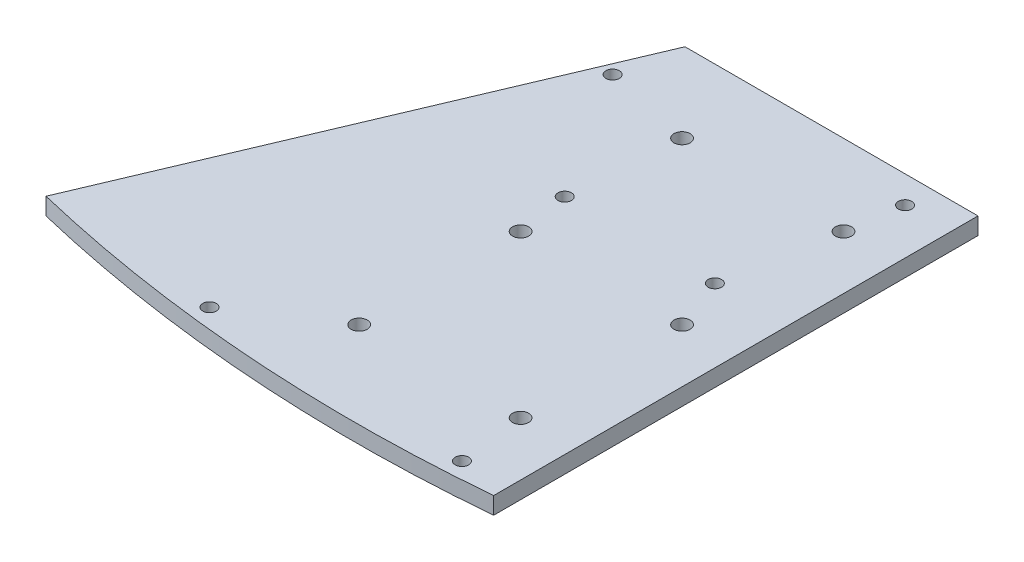
ISO-10303-21;
HEADER;
FILE_DESCRIPTION(('STEP AP214'),'2;1');
FILE_NAME('part.step','',(''),(''),'','','');
FILE_SCHEMA(('AUTOMOTIVE_DESIGN { 1 0 10303 214 1 1 1 1 }'));
ENDSEC;
DATA;
#1=APPLICATION_CONTEXT('core data for automotive mechanical design processes');
#2=APPLICATION_PROTOCOL_DEFINITION('international standard','automotive_design',2000,#1);
#3=PRODUCT_CONTEXT('',#1,'mechanical');
#4=PRODUCT('Part','Part','',(#3));
#5=PRODUCT_RELATED_PRODUCT_CATEGORY('part','',(#4));
#6=PRODUCT_DEFINITION_FORMATION('','',#4);
#7=PRODUCT_DEFINITION_CONTEXT('part definition',#1,'design');
#8=PRODUCT_DEFINITION('design','',#6,#7);
#9=PRODUCT_DEFINITION_SHAPE('','',#8);
#10=(LENGTH_UNIT() NAMED_UNIT(*) SI_UNIT(.MILLI.,.METRE.));
#11=(NAMED_UNIT(*) PLANE_ANGLE_UNIT() SI_UNIT($,.RADIAN.));
#12=(NAMED_UNIT(*) SI_UNIT($,.STERADIAN.) SOLID_ANGLE_UNIT());
#13=UNCERTAINTY_MEASURE_WITH_UNIT(LENGTH_MEASURE(1.E-05),#10,'distance_accuracy_value','');
#14=(GEOMETRIC_REPRESENTATION_CONTEXT(3) GLOBAL_UNCERTAINTY_ASSIGNED_CONTEXT((#13)) GLOBAL_UNIT_ASSIGNED_CONTEXT((#10,
#11,#12)) REPRESENTATION_CONTEXT('',''));
#15=CARTESIAN_POINT('',(0.,0.,0.));
#16=DIRECTION('',(0.,0.,1.));
#17=DIRECTION('',(1.,0.,0.));
#18=AXIS2_PLACEMENT_3D('',#15,#16,#17);
#19=CARTESIAN_POINT('',(-15.,3.175,-260.));
#20=DIRECTION('',(0.,1.,0.));
#21=DIRECTION('',(0.,0.,1.));
#22=AXIS2_PLACEMENT_3D('',#19,#20,#21);
#23=PLANE('',#22);
#24=CARTESIAN_POINT('',(-46.7,3.175,11.1));
#25=DIRECTION('',(0.,1.,0.));
#26=DIRECTION('',(0.,0.,1.));
#27=AXIS2_PLACEMENT_3D('',#24,#25,#26);
#28=CIRCLE('',#27,1.25);
#29=CARTESIAN_POINT('',(-46.7,3.175,12.35));
#30=VERTEX_POINT('',#29);
#31=EDGE_CURVE('E168',#30,#30,#28,.T.);
#32=ORIENTED_EDGE('',*,*,#31,.F.);
#33=EDGE_LOOP('',(#32));
#34=FACE_BOUND('',#33,.T.);
#35=CARTESIAN_POINT('',(-31.5,3.175,-39.7));
#36=DIRECTION('',(0.,1.,0.));
#37=DIRECTION('',(0.,0.,1.));
#38=AXIS2_PLACEMENT_3D('',#35,#36,#37);
#39=CIRCLE('',#38,1.25);
#40=CARTESIAN_POINT('',(-31.5,3.175,-38.45));
#41=VERTEX_POINT('',#40);
#42=EDGE_CURVE('E156',#41,#41,#39,.T.);
#43=ORIENTED_EDGE('',*,*,#42,.F.);
#44=EDGE_LOOP('',(#43));
#45=FACE_BOUND('',#44,.T.);
#46=CARTESIAN_POINT('',(-46.7,3.175,-63.8));
#47=DIRECTION('',(0.,1.,0.));
#48=DIRECTION('',(0.,0.,1.));
#49=AXIS2_PLACEMENT_3D('',#46,#47,#48);
#50=CIRCLE('',#49,1.25);
#51=CARTESIAN_POINT('',(-46.7,3.175,-62.55));
#52=VERTEX_POINT('',#51);
#53=EDGE_CURVE('E144',#52,#52,#50,.T.);
#54=ORIENTED_EDGE('',*,*,#53,.F.);
#55=EDGE_LOOP('',(#54));
#56=FACE_BOUND('',#55,.T.);
#57=CARTESIAN_POINT('',(0.,3.175,-60.));
#58=DIRECTION('',(0.,1.,0.));
#59=DIRECTION('',(0.,0.,1.));
#60=AXIS2_PLACEMENT_3D('',#57,#58,#59);
#61=CIRCLE('',#60,1.5);
#62=CARTESIAN_POINT('',(0.,3.175,-58.5));
#63=VERTEX_POINT('',#62);
#64=EDGE_CURVE('E132',#63,#63,#61,.T.);
#65=ORIENTED_EDGE('',*,*,#64,.F.);
#66=EDGE_LOOP('',(#65));
#67=FACE_BOUND('',#66,.T.);
#68=CARTESIAN_POINT('',(-30.,3.175,-30.));
#69=DIRECTION('',(0.,1.,0.));
#70=DIRECTION('',(0.,0.,1.));
#71=AXIS2_PLACEMENT_3D('',#68,#69,#70);
#72=CIRCLE('',#71,1.5);
#73=CARTESIAN_POINT('',(-30.,3.175,-28.5));
#74=VERTEX_POINT('',#73);
#75=EDGE_CURVE('E120',#74,#74,#72,.T.);
#76=ORIENTED_EDGE('',*,*,#75,.F.);
#77=EDGE_LOOP('',(#76));
#78=FACE_BOUND('',#77,.T.);
#79=CARTESIAN_POINT('',(0.,3.175,0.));
#80=DIRECTION('',(0.,1.,0.));
#81=DIRECTION('',(0.,0.,1.));
#82=AXIS2_PLACEMENT_3D('',#79,#80,#81);
#83=CIRCLE('',#82,1.5);
#84=CARTESIAN_POINT('',(0.,3.175,1.5));
#85=VERTEX_POINT('',#84);
#86=EDGE_CURVE('E99',#85,#85,#83,.T.);
#87=ORIENTED_EDGE('',*,*,#86,.F.);
#88=EDGE_LOOP('',(#87));
#89=FACE_BOUND('',#88,.T.);
#90=CARTESIAN_POINT('',(-15.,3.175,-260.));
#91=DIRECTION('',(0.,1.,0.));
#92=DIRECTION('',(0.,0.,1.));
#93=AXIS2_PLACEMENT_3D('',#90,#91,#92);
#94=CIRCLE('',#93,276.134025429682);
#95=CARTESIAN_POINT('',(-79.768950838685,3.175,8.4305925323267));
#96=VERTEX_POINT('',#95);
#97=CARTESIAN_POINT('',(10.,3.175,15.));
#98=VERTEX_POINT('',#97);
#99=EDGE_CURVE('E84',#96,#98,#94,.T.);
#100=ORIENTED_EDGE('',*,*,#99,.T.);
#101=DIRECTION('',(0.,0.,-1.));
#102=VECTOR('',#101,1.);
#103=CARTESIAN_POINT('',(9.99999999999999,3.175,-75.));
#104=LINE('',#103,#102);
#105=CARTESIAN_POINT('',(9.99999999999999,3.175,-75.));
#106=VERTEX_POINT('',#105);
#107=EDGE_CURVE('E79',#98,#106,#104,.T.);
#108=ORIENTED_EDGE('',*,*,#107,.T.);
#109=DIRECTION('',(-1.,0.,0.));
#110=VECTOR('',#109,1.);
#111=CARTESIAN_POINT('',(-44.45,3.175,-75.));
#112=LINE('',#111,#110);
#113=CARTESIAN_POINT('',(-44.45,3.175,-75.));
#114=VERTEX_POINT('',#113);
#115=EDGE_CURVE('E82',#106,#114,#112,.T.);
#116=ORIENTED_EDGE('',*,*,#115,.T.);
#117=DIRECTION('',(-0.389840257198187,0.,0.920882497318551));
#118=VECTOR('',#117,1.);
#119=CARTESIAN_POINT('',(-44.45,3.175,-75.));
#120=LINE('',#119,#118);
#121=EDGE_CURVE('E49',#114,#96,#120,.T.);
#122=ORIENTED_EDGE('',*,*,#121,.T.);
#123=EDGE_LOOP('',(#100,#108,#116,#122));
#124=FACE_BOUND('',#123,.T.);
#125=CARTESIAN_POINT('',(-30.,3.175,0.));
#126=DIRECTION('',(0.,1.,0.));
#127=DIRECTION('',(0.,0.,1.));
#128=AXIS2_PLACEMENT_3D('',#125,#126,#127);
#129=CIRCLE('',#128,1.50000000000001);
#130=CARTESIAN_POINT('',(-30.,3.175,1.50000000000001));
#131=VERTEX_POINT('',#130);
#132=EDGE_CURVE('E114',#131,#131,#129,.T.);
#133=ORIENTED_EDGE('',*,*,#132,.F.);
#134=EDGE_LOOP('',(#133));
#135=FACE_BOUND('',#134,.T.);
#136=CARTESIAN_POINT('',(-30.,3.175,-60.));
#137=DIRECTION('',(0.,1.,0.));
#138=DIRECTION('',(0.,0.,1.));
#139=AXIS2_PLACEMENT_3D('',#136,#137,#138);
#140=CIRCLE('',#139,1.5);
#141=CARTESIAN_POINT('',(-30.,3.175,-58.5));
#142=VERTEX_POINT('',#141);
#143=EDGE_CURVE('E126',#142,#142,#140,.T.);
#144=ORIENTED_EDGE('',*,*,#143,.F.);
#145=EDGE_LOOP('',(#144));
#146=FACE_BOUND('',#145,.T.);
#147=CARTESIAN_POINT('',(0.,3.175,-30.));
#148=DIRECTION('',(0.,1.,0.));
#149=DIRECTION('',(0.,0.,1.));
#150=AXIS2_PLACEMENT_3D('',#147,#148,#149);
#151=CIRCLE('',#150,1.5);
#152=CARTESIAN_POINT('',(0.,3.175,-28.5));
#153=VERTEX_POINT('',#152);
#154=EDGE_CURVE('E138',#153,#153,#151,.T.);
#155=ORIENTED_EDGE('',*,*,#154,.F.);
#156=EDGE_LOOP('',(#155));
#157=FACE_BOUND('',#156,.T.);
#158=CARTESIAN_POINT('',(1.49999999999999,3.175,-69.95));
#159=DIRECTION('',(0.,1.,0.));
#160=DIRECTION('',(0.,0.,1.));
#161=AXIS2_PLACEMENT_3D('',#158,#159,#160);
#162=CIRCLE('',#161,1.25);
#163=CARTESIAN_POINT('',(1.49999999999999,3.175,-68.7));
#164=VERTEX_POINT('',#163);
#165=EDGE_CURVE('E150',#164,#164,#162,.T.);
#166=ORIENTED_EDGE('',*,*,#165,.F.);
#167=EDGE_LOOP('',(#166));
#168=FACE_BOUND('',#167,.T.);
#169=CARTESIAN_POINT('',(-3.60000000000002,3.175,-39.7));
#170=DIRECTION('',(0.,1.,0.));
#171=DIRECTION('',(0.,0.,1.));
#172=AXIS2_PLACEMENT_3D('',#169,#170,#171);
#173=CIRCLE('',#172,1.25);
#174=CARTESIAN_POINT('',(-3.60000000000002,3.175,-38.45));
#175=VERTEX_POINT('',#174);
#176=EDGE_CURVE('E162',#175,#175,#173,.T.);
#177=ORIENTED_EDGE('',*,*,#176,.F.);
#178=EDGE_LOOP('',(#177));
#179=FACE_BOUND('',#178,.T.);
#180=CARTESIAN_POINT('',(1.5,3.175,12.4));
#181=DIRECTION('',(0.,1.,0.));
#182=DIRECTION('',(0.,0.,1.));
#183=AXIS2_PLACEMENT_3D('',#180,#181,#182);
#184=CIRCLE('',#183,1.25);
#185=CARTESIAN_POINT('',(1.5,3.175,13.65));
#186=VERTEX_POINT('',#185);
#187=EDGE_CURVE('E174',#186,#186,#184,.T.);
#188=ORIENTED_EDGE('',*,*,#187,.F.);
#189=EDGE_LOOP('',(#188));
#190=FACE_BOUND('',#189,.T.);
#191=ADVANCED_FACE('F32',(#34,#45,#56,#67,#78,#89,#124,#135,#146,#157,#168,#179,#190),#23,.T.);
#192=CARTESIAN_POINT('',(-15.,0.,-260.));
#193=DIRECTION('',(0.,1.,0.));
#194=DIRECTION('',(0.,0.,1.));
#195=AXIS2_PLACEMENT_3D('',#192,#193,#194);
#196=PLANE('',#195);
#197=CARTESIAN_POINT('',(-46.7,0.,11.1));
#198=DIRECTION('',(0.,1.,0.));
#199=DIRECTION('',(0.,0.,1.));
#200=AXIS2_PLACEMENT_3D('',#197,#198,#199);
#201=CIRCLE('',#200,1.25);
#202=CARTESIAN_POINT('',(-46.7,0.,12.35));
#203=VERTEX_POINT('',#202);
#204=EDGE_CURVE('E171',#203,#203,#201,.T.);
#205=ORIENTED_EDGE('',*,*,#204,.T.);
#206=EDGE_LOOP('',(#205));
#207=FACE_BOUND('',#206,.T.);
#208=CARTESIAN_POINT('',(-31.5,0.,-39.7));
#209=DIRECTION('',(0.,1.,0.));
#210=DIRECTION('',(0.,0.,1.));
#211=AXIS2_PLACEMENT_3D('',#208,#209,#210);
#212=CIRCLE('',#211,1.25);
#213=CARTESIAN_POINT('',(-31.5,0.,-38.45));
#214=VERTEX_POINT('',#213);
#215=EDGE_CURVE('E159',#214,#214,#212,.T.);
#216=ORIENTED_EDGE('',*,*,#215,.T.);
#217=EDGE_LOOP('',(#216));
#218=FACE_BOUND('',#217,.T.);
#219=CARTESIAN_POINT('',(-46.7,0.,-63.8));
#220=DIRECTION('',(0.,1.,0.));
#221=DIRECTION('',(0.,0.,1.));
#222=AXIS2_PLACEMENT_3D('',#219,#220,#221);
#223=CIRCLE('',#222,1.25);
#224=CARTESIAN_POINT('',(-46.7,0.,-62.55));
#225=VERTEX_POINT('',#224);
#226=EDGE_CURVE('E147',#225,#225,#223,.T.);
#227=ORIENTED_EDGE('',*,*,#226,.T.);
#228=EDGE_LOOP('',(#227));
#229=FACE_BOUND('',#228,.T.);
#230=CARTESIAN_POINT('',(0.,0.,-60.));
#231=DIRECTION('',(0.,1.,0.));
#232=DIRECTION('',(0.,0.,1.));
#233=AXIS2_PLACEMENT_3D('',#230,#231,#232);
#234=CIRCLE('',#233,1.5);
#235=CARTESIAN_POINT('',(0.,0.,-58.5));
#236=VERTEX_POINT('',#235);
#237=EDGE_CURVE('E135',#236,#236,#234,.T.);
#238=ORIENTED_EDGE('',*,*,#237,.T.);
#239=EDGE_LOOP('',(#238));
#240=FACE_BOUND('',#239,.T.);
#241=CARTESIAN_POINT('',(-30.,0.,-30.));
#242=DIRECTION('',(0.,1.,0.));
#243=DIRECTION('',(0.,0.,1.));
#244=AXIS2_PLACEMENT_3D('',#241,#242,#243);
#245=CIRCLE('',#244,1.5);
#246=CARTESIAN_POINT('',(-30.,0.,-28.5));
#247=VERTEX_POINT('',#246);
#248=EDGE_CURVE('E123',#247,#247,#245,.T.);
#249=ORIENTED_EDGE('',*,*,#248,.T.);
#250=EDGE_LOOP('',(#249));
#251=FACE_BOUND('',#250,.T.);
#252=CARTESIAN_POINT('',(0.,0.,0.));
#253=DIRECTION('',(0.,1.,0.));
#254=DIRECTION('',(0.,0.,1.));
#255=AXIS2_PLACEMENT_3D('',#252,#253,#254);
#256=CIRCLE('',#255,1.5);
#257=CARTESIAN_POINT('',(0.,0.,1.5));
#258=VERTEX_POINT('',#257);
#259=EDGE_CURVE('E111',#258,#258,#256,.T.);
#260=ORIENTED_EDGE('',*,*,#259,.T.);
#261=EDGE_LOOP('',(#260));
#262=FACE_BOUND('',#261,.T.);
#263=CARTESIAN_POINT('',(-15.,0.,-260.));
#264=DIRECTION('',(0.,1.,0.));
#265=DIRECTION('',(0.,0.,1.));
#266=AXIS2_PLACEMENT_3D('',#263,#264,#265);
#267=CIRCLE('',#266,276.134025429682);
#268=CARTESIAN_POINT('',(-79.768950838685,0.,8.4305925323267));
#269=VERTEX_POINT('',#268);
#270=CARTESIAN_POINT('',(10.,0.,15.));
#271=VERTEX_POINT('',#270);
#272=EDGE_CURVE('E96',#269,#271,#267,.T.);
#273=ORIENTED_EDGE('',*,*,#272,.F.);
#274=DIRECTION('',(-0.389840257198187,0.,0.920882497318551));
#275=VECTOR('',#274,1.);
#276=CARTESIAN_POINT('',(-44.45,0.,-75.));
#277=LINE('',#276,#275);
#278=CARTESIAN_POINT('',(-44.45,0.,-75.));
#279=VERTEX_POINT('',#278);
#280=EDGE_CURVE('E72',#279,#269,#277,.T.);
#281=ORIENTED_EDGE('',*,*,#280,.F.);
#282=DIRECTION('',(-1.,0.,0.));
#283=VECTOR('',#282,1.);
#284=CARTESIAN_POINT('',(-44.45,0.,-75.));
#285=LINE('',#284,#283);
#286=CARTESIAN_POINT('',(9.99999999999999,0.,-75.));
#287=VERTEX_POINT('',#286);
#288=EDGE_CURVE('E66',#287,#279,#285,.T.);
#289=ORIENTED_EDGE('',*,*,#288,.F.);
#290=DIRECTION('',(0.,0.,-1.));
#291=VECTOR('',#290,1.);
#292=CARTESIAN_POINT('',(9.99999999999999,0.,-75.));
#293=LINE('',#292,#291);
#294=EDGE_CURVE('E88',#271,#287,#293,.T.);
#295=ORIENTED_EDGE('',*,*,#294,.F.);
#296=EDGE_LOOP('',(#273,#281,#289,#295));
#297=FACE_BOUND('',#296,.T.);
#298=CARTESIAN_POINT('',(-30.,0.,0.));
#299=DIRECTION('',(0.,1.,0.));
#300=DIRECTION('',(0.,0.,1.));
#301=AXIS2_PLACEMENT_3D('',#298,#299,#300);
#302=CIRCLE('',#301,1.50000000000001);
#303=CARTESIAN_POINT('',(-30.,0.,1.50000000000001));
#304=VERTEX_POINT('',#303);
#305=EDGE_CURVE('E117',#304,#304,#302,.T.);
#306=ORIENTED_EDGE('',*,*,#305,.T.);
#307=EDGE_LOOP('',(#306));
#308=FACE_BOUND('',#307,.T.);
#309=CARTESIAN_POINT('',(-30.,0.,-60.));
#310=DIRECTION('',(0.,1.,0.));
#311=DIRECTION('',(0.,0.,1.));
#312=AXIS2_PLACEMENT_3D('',#309,#310,#311);
#313=CIRCLE('',#312,1.5);
#314=CARTESIAN_POINT('',(-30.,0.,-58.5));
#315=VERTEX_POINT('',#314);
#316=EDGE_CURVE('E129',#315,#315,#313,.T.);
#317=ORIENTED_EDGE('',*,*,#316,.T.);
#318=EDGE_LOOP('',(#317));
#319=FACE_BOUND('',#318,.T.);
#320=CARTESIAN_POINT('',(0.,0.,-30.));
#321=DIRECTION('',(0.,1.,0.));
#322=DIRECTION('',(0.,0.,1.));
#323=AXIS2_PLACEMENT_3D('',#320,#321,#322);
#324=CIRCLE('',#323,1.5);
#325=CARTESIAN_POINT('',(0.,0.,-28.5));
#326=VERTEX_POINT('',#325);
#327=EDGE_CURVE('E141',#326,#326,#324,.T.);
#328=ORIENTED_EDGE('',*,*,#327,.T.);
#329=EDGE_LOOP('',(#328));
#330=FACE_BOUND('',#329,.T.);
#331=CARTESIAN_POINT('',(1.49999999999999,0.,-69.95));
#332=DIRECTION('',(0.,1.,0.));
#333=DIRECTION('',(0.,0.,1.));
#334=AXIS2_PLACEMENT_3D('',#331,#332,#333);
#335=CIRCLE('',#334,1.25);
#336=CARTESIAN_POINT('',(1.49999999999999,0.,-68.7));
#337=VERTEX_POINT('',#336);
#338=EDGE_CURVE('E153',#337,#337,#335,.T.);
#339=ORIENTED_EDGE('',*,*,#338,.T.);
#340=EDGE_LOOP('',(#339));
#341=FACE_BOUND('',#340,.T.);
#342=CARTESIAN_POINT('',(-3.60000000000002,0.,-39.7));
#343=DIRECTION('',(0.,1.,0.));
#344=DIRECTION('',(0.,0.,1.));
#345=AXIS2_PLACEMENT_3D('',#342,#343,#344);
#346=CIRCLE('',#345,1.25);
#347=CARTESIAN_POINT('',(-3.60000000000002,0.,-38.45));
#348=VERTEX_POINT('',#347);
#349=EDGE_CURVE('E165',#348,#348,#346,.T.);
#350=ORIENTED_EDGE('',*,*,#349,.T.);
#351=EDGE_LOOP('',(#350));
#352=FACE_BOUND('',#351,.T.);
#353=CARTESIAN_POINT('',(1.5,0.,12.4));
#354=DIRECTION('',(0.,1.,0.));
#355=DIRECTION('',(0.,0.,1.));
#356=AXIS2_PLACEMENT_3D('',#353,#354,#355);
#357=CIRCLE('',#356,1.25);
#358=CARTESIAN_POINT('',(1.5,0.,13.65));
#359=VERTEX_POINT('',#358);
#360=EDGE_CURVE('E177',#359,#359,#357,.T.);
#361=ORIENTED_EDGE('',*,*,#360,.T.);
#362=EDGE_LOOP('',(#361));
#363=FACE_BOUND('',#362,.T.);
#364=ADVANCED_FACE('F107',(#207,#218,#229,#240,#251,#262,#297,#308,#319,#330,#341,#352,#363),
#196,.F.);
#365=CARTESIAN_POINT('',(-15.,3.175,-260.));
#366=DIRECTION('',(0.,-1.,0.));
#367=DIRECTION('',(0.,0.,-1.));
#368=AXIS2_PLACEMENT_3D('',#365,#366,#367);
#369=CYLINDRICAL_SURFACE('',#368,276.134025429682);
#370=ORIENTED_EDGE('',*,*,#272,.T.);
#371=DIRECTION('',(0.,-1.,0.));
#372=VECTOR('',#371,1.);
#373=CARTESIAN_POINT('',(10.,3.175,15.));
#374=LINE('',#373,#372);
#375=EDGE_CURVE('E11',#98,#271,#374,.T.);
#376=ORIENTED_EDGE('',*,*,#375,.F.);
#377=ORIENTED_EDGE('',*,*,#99,.F.);
#378=DIRECTION('',(0.,-1.,0.));
#379=VECTOR('',#378,1.);
#380=CARTESIAN_POINT('',(-79.768950838685,3.175,8.4305925323267));
#381=LINE('',#380,#379);
#382=EDGE_CURVE('E92',#96,#269,#381,.T.);
#383=ORIENTED_EDGE('',*,*,#382,.T.);
#384=EDGE_LOOP('',(#370,#376,#377,#383));
#385=FACE_BOUND('',#384,.T.);
#386=ADVANCED_FACE('F34',(#385),#369,.T.);
#387=CARTESIAN_POINT('',(9.99999999999999,3.175,-75.));
#388=DIRECTION('',(-1.,0.,0.));
#389=DIRECTION('',(0.,0.,1.));
#390=AXIS2_PLACEMENT_3D('',#387,#388,#389);
#391=PLANE('',#390);
#392=ORIENTED_EDGE('',*,*,#294,.T.);
#393=DIRECTION('',(0.,-1.,0.));
#394=VECTOR('',#393,1.);
#395=CARTESIAN_POINT('',(9.99999999999999,3.175,-75.));
#396=LINE('',#395,#394);
#397=EDGE_CURVE('E41',#106,#287,#396,.T.);
#398=ORIENTED_EDGE('',*,*,#397,.F.);
#399=ORIENTED_EDGE('',*,*,#107,.F.);
#400=ORIENTED_EDGE('',*,*,#375,.T.);
#401=EDGE_LOOP('',(#392,#398,#399,#400));
#402=FACE_BOUND('',#401,.T.);
#403=ADVANCED_FACE('F87',(#402),#391,.F.);
#404=CARTESIAN_POINT('',(-44.45,3.175,-75.));
#405=DIRECTION('',(0.,0.,1.));
#406=DIRECTION('',(1.,0.,0.));
#407=AXIS2_PLACEMENT_3D('',#404,#405,#406);
#408=PLANE('',#407);
#409=ORIENTED_EDGE('',*,*,#288,.T.);
#410=DIRECTION('',(0.,-1.,0.));
#411=VECTOR('',#410,1.);
#412=CARTESIAN_POINT('',(-44.45,3.175,-75.));
#413=LINE('',#412,#411);
#414=EDGE_CURVE('E89',#114,#279,#413,.T.);
#415=ORIENTED_EDGE('',*,*,#414,.F.);
#416=ORIENTED_EDGE('',*,*,#115,.F.);
#417=ORIENTED_EDGE('',*,*,#397,.T.);
#418=EDGE_LOOP('',(#409,#415,#416,#417));
#419=FACE_BOUND('',#418,.T.);
#420=ADVANCED_FACE('F90',(#419),#408,.F.);
#421=CARTESIAN_POINT('',(-44.45,3.175,-75.));
#422=DIRECTION('',(0.920882497318551,0.,0.389840257198187));
#423=DIRECTION('',(0.389840257198187,0.,-0.920882497318551));
#424=AXIS2_PLACEMENT_3D('',#421,#422,#423);
#425=PLANE('',#424);
#426=ORIENTED_EDGE('',*,*,#280,.T.);
#427=ORIENTED_EDGE('',*,*,#382,.F.);
#428=ORIENTED_EDGE('',*,*,#121,.F.);
#429=ORIENTED_EDGE('',*,*,#414,.T.);
#430=EDGE_LOOP('',(#426,#427,#428,#429));
#431=FACE_BOUND('',#430,.T.);
#432=ADVANCED_FACE('F104',(#431),#425,.F.);
#433=CARTESIAN_POINT('',(0.,3.175,0.));
#434=DIRECTION('',(0.,-1.,0.));
#435=DIRECTION('',(0.,0.,-1.));
#436=AXIS2_PLACEMENT_3D('',#433,#434,#435);
#437=CYLINDRICAL_SURFACE('',#436,1.5);
#438=ORIENTED_EDGE('',*,*,#86,.T.);
#439=EDGE_LOOP('',(#438));
#440=FACE_BOUND('',#439,.T.);
#441=ORIENTED_EDGE('',*,*,#259,.F.);
#442=EDGE_LOOP('',(#441));
#443=FACE_BOUND('',#442,.T.);
#444=ADVANCED_FACE('F197',(#440,#443),#437,.F.);
#445=CARTESIAN_POINT('',(-30.,3.175,0.));
#446=DIRECTION('',(0.,-1.,0.));
#447=DIRECTION('',(0.,0.,-1.));
#448=AXIS2_PLACEMENT_3D('',#445,#446,#447);
#449=CYLINDRICAL_SURFACE('',#448,1.50000000000001);
#450=ORIENTED_EDGE('',*,*,#132,.T.);
#451=EDGE_LOOP('',(#450));
#452=FACE_BOUND('',#451,.T.);
#453=ORIENTED_EDGE('',*,*,#305,.F.);
#454=EDGE_LOOP('',(#453));
#455=FACE_BOUND('',#454,.T.);
#456=ADVANCED_FACE('F243',(#452,#455),#449,.F.);
#457=CARTESIAN_POINT('',(-30.,3.175,-30.));
#458=DIRECTION('',(0.,-1.,0.));
#459=DIRECTION('',(0.,0.,-1.));
#460=AXIS2_PLACEMENT_3D('',#457,#458,#459);
#461=CYLINDRICAL_SURFACE('',#460,1.5);
#462=ORIENTED_EDGE('',*,*,#75,.T.);
#463=EDGE_LOOP('',(#462));
#464=FACE_BOUND('',#463,.T.);
#465=ORIENTED_EDGE('',*,*,#248,.F.);
#466=EDGE_LOOP('',(#465));
#467=FACE_BOUND('',#466,.T.);
#468=ADVANCED_FACE('F251',(#464,#467),#461,.F.);
#469=CARTESIAN_POINT('',(-30.,3.175,-60.));
#470=DIRECTION('',(0.,-1.,0.));
#471=DIRECTION('',(0.,0.,-1.));
#472=AXIS2_PLACEMENT_3D('',#469,#470,#471);
#473=CYLINDRICAL_SURFACE('',#472,1.5);
#474=ORIENTED_EDGE('',*,*,#143,.T.);
#475=EDGE_LOOP('',(#474));
#476=FACE_BOUND('',#475,.T.);
#477=ORIENTED_EDGE('',*,*,#316,.F.);
#478=EDGE_LOOP('',(#477));
#479=FACE_BOUND('',#478,.T.);
#480=ADVANCED_FACE('F259',(#476,#479),#473,.F.);
#481=CARTESIAN_POINT('',(0.,3.175,-60.));
#482=DIRECTION('',(0.,-1.,0.));
#483=DIRECTION('',(0.,0.,-1.));
#484=AXIS2_PLACEMENT_3D('',#481,#482,#483);
#485=CYLINDRICAL_SURFACE('',#484,1.5);
#486=ORIENTED_EDGE('',*,*,#64,.T.);
#487=EDGE_LOOP('',(#486));
#488=FACE_BOUND('',#487,.T.);
#489=ORIENTED_EDGE('',*,*,#237,.F.);
#490=EDGE_LOOP('',(#489));
#491=FACE_BOUND('',#490,.T.);
#492=ADVANCED_FACE('F268',(#488,#491),#485,.F.);
#493=CARTESIAN_POINT('',(0.,3.175,-30.));
#494=DIRECTION('',(0.,-1.,0.));
#495=DIRECTION('',(0.,0.,-1.));
#496=AXIS2_PLACEMENT_3D('',#493,#494,#495);
#497=CYLINDRICAL_SURFACE('',#496,1.5);
#498=ORIENTED_EDGE('',*,*,#154,.T.);
#499=EDGE_LOOP('',(#498));
#500=FACE_BOUND('',#499,.T.);
#501=ORIENTED_EDGE('',*,*,#327,.F.);
#502=EDGE_LOOP('',(#501));
#503=FACE_BOUND('',#502,.T.);
#504=ADVANCED_FACE('F277',(#500,#503),#497,.F.);
#505=CARTESIAN_POINT('',(-46.7,3.175,-63.8));
#506=DIRECTION('',(0.,-1.,0.));
#507=DIRECTION('',(0.,0.,-1.));
#508=AXIS2_PLACEMENT_3D('',#505,#506,#507);
#509=CYLINDRICAL_SURFACE('',#508,1.25);
#510=ORIENTED_EDGE('',*,*,#53,.T.);
#511=EDGE_LOOP('',(#510));
#512=FACE_BOUND('',#511,.T.);
#513=ORIENTED_EDGE('',*,*,#226,.F.);
#514=EDGE_LOOP('',(#513));
#515=FACE_BOUND('',#514,.T.);
#516=ADVANCED_FACE('F286',(#512,#515),#509,.F.);
#517=CARTESIAN_POINT('',(1.49999999999999,3.175,-69.95));
#518=DIRECTION('',(0.,-1.,0.));
#519=DIRECTION('',(0.,0.,-1.));
#520=AXIS2_PLACEMENT_3D('',#517,#518,#519);
#521=CYLINDRICAL_SURFACE('',#520,1.25);
#522=ORIENTED_EDGE('',*,*,#165,.T.);
#523=EDGE_LOOP('',(#522));
#524=FACE_BOUND('',#523,.T.);
#525=ORIENTED_EDGE('',*,*,#338,.F.);
#526=EDGE_LOOP('',(#525));
#527=FACE_BOUND('',#526,.T.);
#528=ADVANCED_FACE('F295',(#524,#527),#521,.F.);
#529=CARTESIAN_POINT('',(-31.5,3.175,-39.7));
#530=DIRECTION('',(0.,-1.,0.));
#531=DIRECTION('',(0.,0.,-1.));
#532=AXIS2_PLACEMENT_3D('',#529,#530,#531);
#533=CYLINDRICAL_SURFACE('',#532,1.25);
#534=ORIENTED_EDGE('',*,*,#42,.T.);
#535=EDGE_LOOP('',(#534));
#536=FACE_BOUND('',#535,.T.);
#537=ORIENTED_EDGE('',*,*,#215,.F.);
#538=EDGE_LOOP('',(#537));
#539=FACE_BOUND('',#538,.T.);
#540=ADVANCED_FACE('F304',(#536,#539),#533,.F.);
#541=CARTESIAN_POINT('',(-3.60000000000002,3.175,-39.7));
#542=DIRECTION('',(0.,-1.,0.));
#543=DIRECTION('',(0.,0.,-1.));
#544=AXIS2_PLACEMENT_3D('',#541,#542,#543);
#545=CYLINDRICAL_SURFACE('',#544,1.25);
#546=ORIENTED_EDGE('',*,*,#176,.T.);
#547=EDGE_LOOP('',(#546));
#548=FACE_BOUND('',#547,.T.);
#549=ORIENTED_EDGE('',*,*,#349,.F.);
#550=EDGE_LOOP('',(#549));
#551=FACE_BOUND('',#550,.T.);
#552=ADVANCED_FACE('F313',(#548,#551),#545,.F.);
#553=CARTESIAN_POINT('',(-46.7,3.175,11.1));
#554=DIRECTION('',(0.,-1.,0.));
#555=DIRECTION('',(0.,0.,-1.));
#556=AXIS2_PLACEMENT_3D('',#553,#554,#555);
#557=CYLINDRICAL_SURFACE('',#556,1.25);
#558=ORIENTED_EDGE('',*,*,#31,.T.);
#559=EDGE_LOOP('',(#558));
#560=FACE_BOUND('',#559,.T.);
#561=ORIENTED_EDGE('',*,*,#204,.F.);
#562=EDGE_LOOP('',(#561));
#563=FACE_BOUND('',#562,.T.);
#564=ADVANCED_FACE('F322',(#560,#563),#557,.F.);
#565=CARTESIAN_POINT('',(1.5,3.175,12.4));
#566=DIRECTION('',(0.,-1.,0.));
#567=DIRECTION('',(0.,0.,-1.));
#568=AXIS2_PLACEMENT_3D('',#565,#566,#567);
#569=CYLINDRICAL_SURFACE('',#568,1.25);
#570=ORIENTED_EDGE('',*,*,#187,.T.);
#571=EDGE_LOOP('',(#570));
#572=FACE_BOUND('',#571,.T.);
#573=ORIENTED_EDGE('',*,*,#360,.F.);
#574=EDGE_LOOP('',(#573));
#575=FACE_BOUND('',#574,.T.);
#576=ADVANCED_FACE('F183',(#572,#575),#569,.F.);
#577=CLOSED_SHELL('',(#191,#364,#386,#403,#420,#432,#444,#456,#468,#480,#492,#504,#516,#528,
#540,#552,#564,#576));
#578=MANIFOLD_SOLID_BREP('B2',#577);
#579=ADVANCED_BREP_SHAPE_REPRESENTATION('',(#18,#578),#14);
#580=SHAPE_DEFINITION_REPRESENTATION(#9,#579);
ENDSEC;
END-ISO-10303-21;
